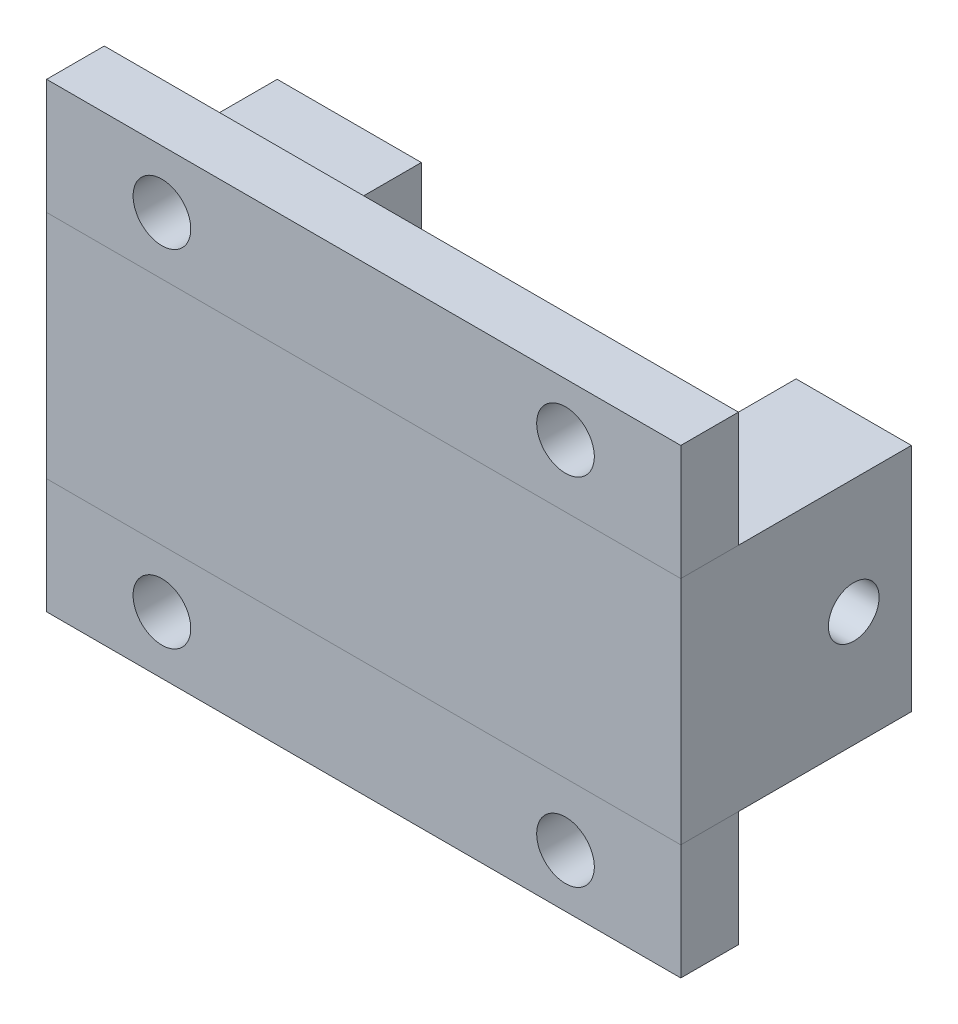
ISO-10303-21;
HEADER;
FILE_DESCRIPTION(('STEP AP214'),'2;1');
FILE_NAME('part.step','',(''),(''),'','','');
FILE_SCHEMA(('AUTOMOTIVE_DESIGN { 1 0 10303 214 1 1 1 1 }'));
ENDSEC;
DATA;
#1=APPLICATION_CONTEXT('core data for automotive mechanical design processes');
#2=APPLICATION_PROTOCOL_DEFINITION('international standard','automotive_design',2000,#1);
#3=PRODUCT_CONTEXT('',#1,'mechanical');
#4=PRODUCT('Part','Part','',(#3));
#5=PRODUCT_RELATED_PRODUCT_CATEGORY('part','',(#4));
#6=PRODUCT_DEFINITION_FORMATION('','',#4);
#7=PRODUCT_DEFINITION_CONTEXT('part definition',#1,'design');
#8=PRODUCT_DEFINITION('design','',#6,#7);
#9=PRODUCT_DEFINITION_SHAPE('','',#8);
#10=(LENGTH_UNIT() NAMED_UNIT(*) SI_UNIT(.MILLI.,.METRE.));
#11=(NAMED_UNIT(*) PLANE_ANGLE_UNIT() SI_UNIT($,.RADIAN.));
#12=(NAMED_UNIT(*) SI_UNIT($,.STERADIAN.) SOLID_ANGLE_UNIT());
#13=UNCERTAINTY_MEASURE_WITH_UNIT(LENGTH_MEASURE(1.E-05),#10,'distance_accuracy_value','');
#14=(GEOMETRIC_REPRESENTATION_CONTEXT(3) GLOBAL_UNCERTAINTY_ASSIGNED_CONTEXT((#13)) GLOBAL_UNIT_ASSIGNED_CONTEXT((#10,
#11,#12)) REPRESENTATION_CONTEXT('',''));
#15=CARTESIAN_POINT('',(0.,0.,0.));
#16=DIRECTION('',(0.,0.,1.));
#17=DIRECTION('',(1.,0.,0.));
#18=AXIS2_PLACEMENT_3D('',#15,#16,#17);
#19=CARTESIAN_POINT('',(0.,-40.,-10.));
#20=DIRECTION('',(0.,0.,-1.));
#21=DIRECTION('',(-1.,0.,0.));
#22=AXIS2_PLACEMENT_3D('',#19,#20,#21);
#23=PLANE('',#22);
#24=CARTESIAN_POINT('',(20.,-30.,-10.));
#25=DIRECTION('',(0.,0.,1.));
#26=DIRECTION('',(-1.,0.,0.));
#27=AXIS2_PLACEMENT_3D('',#24,#25,#26);
#28=CIRCLE('',#27,5.);
#29=CARTESIAN_POINT('',(15.,-30.,-10.));
#30=VERTEX_POINT('',#29);
#31=EDGE_CURVE('E146',#30,#30,#28,.T.);
#32=ORIENTED_EDGE('',*,*,#31,.T.);
#33=EDGE_LOOP('',(#32));
#34=FACE_BOUND('',#33,.T.);
#35=CARTESIAN_POINT('',(90.,-30.8146167179204,-10.));
#36=DIRECTION('',(0.,0.,1.));
#37=DIRECTION('',(-1.,0.,0.));
#38=AXIS2_PLACEMENT_3D('',#35,#36,#37);
#39=CIRCLE('',#38,5.);
#40=CARTESIAN_POINT('',(85.,-30.8146167179204,-10.));
#41=VERTEX_POINT('',#40);
#42=EDGE_CURVE('E149',#41,#41,#39,.T.);
#43=ORIENTED_EDGE('',*,*,#42,.T.);
#44=EDGE_LOOP('',(#43));
#45=FACE_BOUND('',#44,.T.);
#46=DIRECTION('',(1.,0.,0.));
#47=VECTOR('',#46,1.);
#48=CARTESIAN_POINT('',(0.,-20.,-10.));
#49=LINE('',#48,#47);
#50=CARTESIAN_POINT('',(0.,-20.,-10.));
#51=VERTEX_POINT('',#50);
#52=CARTESIAN_POINT('',(110.,-20.,-10.));
#53=VERTEX_POINT('',#52);
#54=EDGE_CURVE('E115',#51,#53,#49,.T.);
#55=ORIENTED_EDGE('',*,*,#54,.T.);
#56=DIRECTION('',(0.,1.,0.));
#57=VECTOR('',#56,1.);
#58=CARTESIAN_POINT('',(110.,-40.,-10.));
#59=LINE('',#58,#57);
#60=CARTESIAN_POINT('',(110.,-40.,-10.));
#61=VERTEX_POINT('',#60);
#62=EDGE_CURVE('E114',#61,#53,#59,.T.);
#63=ORIENTED_EDGE('',*,*,#62,.F.);
#64=DIRECTION('',(1.,0.,0.));
#65=VECTOR('',#64,1.);
#66=CARTESIAN_POINT('',(0.,-40.,-10.));
#67=LINE('',#66,#65);
#68=CARTESIAN_POINT('',(0.,-40.,-10.));
#69=VERTEX_POINT('',#68);
#70=EDGE_CURVE('E108',#69,#61,#67,.T.);
#71=ORIENTED_EDGE('',*,*,#70,.F.);
#72=DIRECTION('',(0.,1.,0.));
#73=VECTOR('',#72,1.);
#74=CARTESIAN_POINT('',(0.,-40.,-10.));
#75=LINE('',#74,#73);
#76=EDGE_CURVE('E12',#69,#51,#75,.T.);
#77=ORIENTED_EDGE('',*,*,#76,.T.);
#78=EDGE_LOOP('',(#55,#63,#71,#77));
#79=FACE_BOUND('',#78,.T.);
#80=ADVANCED_FACE('F51',(#34,#45,#79),#23,.T.);
#81=CARTESIAN_POINT('',(0.,-40.,0.));
#82=DIRECTION('',(1.,0.,0.));
#83=DIRECTION('',(0.,0.,-1.));
#84=AXIS2_PLACEMENT_3D('',#81,#82,#83);
#85=PLANE('',#84);
#86=DIRECTION('',(0.,0.,1.));
#87=VECTOR('',#86,1.);
#88=CARTESIAN_POINT('',(0.,-20.,0.));
#89=LINE('',#88,#87);
#90=CARTESIAN_POINT('',(0.,-20.,0.));
#91=VERTEX_POINT('',#90);
#92=EDGE_CURVE('E118',#51,#91,#89,.T.);
#93=ORIENTED_EDGE('',*,*,#92,.F.);
#94=ORIENTED_EDGE('',*,*,#76,.F.);
#95=DIRECTION('',(0.,0.,1.));
#96=VECTOR('',#95,1.);
#97=CARTESIAN_POINT('',(0.,-40.,0.));
#98=LINE('',#97,#96);
#99=CARTESIAN_POINT('',(0.,-40.,0.));
#100=VERTEX_POINT('',#99);
#101=EDGE_CURVE('E92',#69,#100,#98,.T.);
#102=ORIENTED_EDGE('',*,*,#101,.T.);
#103=DIRECTION('',(0.,1.,0.));
#104=VECTOR('',#103,1.);
#105=CARTESIAN_POINT('',(0.,-40.,0.));
#106=LINE('',#105,#104);
#107=EDGE_CURVE('E59',#100,#91,#106,.T.);
#108=ORIENTED_EDGE('',*,*,#107,.T.);
#109=EDGE_LOOP('',(#93,#94,#102,#108));
#110=FACE_BOUND('',#109,.T.);
#111=ADVANCED_FACE('F106',(#110),#85,.F.);
#112=CARTESIAN_POINT('',(0.,-40.,0.));
#113=DIRECTION('',(0.,0.,-1.));
#114=DIRECTION('',(-1.,0.,0.));
#115=AXIS2_PLACEMENT_3D('',#112,#113,#114);
#116=PLANE('',#115);
#117=CARTESIAN_POINT('',(20.,-30.,0.));
#118=DIRECTION('',(0.,0.,1.));
#119=DIRECTION('',(-1.,0.,0.));
#120=AXIS2_PLACEMENT_3D('',#117,#118,#119);
#121=CIRCLE('',#120,5.);
#122=CARTESIAN_POINT('',(15.,-30.,0.));
#123=VERTEX_POINT('',#122);
#124=EDGE_CURVE('E151',#123,#123,#121,.T.);
#125=ORIENTED_EDGE('',*,*,#124,.F.);
#126=EDGE_LOOP('',(#125));
#127=FACE_BOUND('',#126,.T.);
#128=CARTESIAN_POINT('',(90.,-30.8146167179204,0.));
#129=DIRECTION('',(0.,0.,1.));
#130=DIRECTION('',(-1.,0.,0.));
#131=AXIS2_PLACEMENT_3D('',#128,#129,#130);
#132=CIRCLE('',#131,5.);
#133=CARTESIAN_POINT('',(85.,-30.8146167179204,0.));
#134=VERTEX_POINT('',#133);
#135=EDGE_CURVE('E119',#134,#134,#132,.T.);
#136=ORIENTED_EDGE('',*,*,#135,.F.);
#137=EDGE_LOOP('',(#136));
#138=FACE_BOUND('',#137,.T.);
#139=DIRECTION('',(1.,0.,0.));
#140=VECTOR('',#139,1.);
#141=CARTESIAN_POINT('',(0.,-20.,0.));
#142=LINE('',#141,#140);
#143=CARTESIAN_POINT('',(110.,-20.,0.));
#144=VERTEX_POINT('',#143);
#145=EDGE_CURVE('E102',#91,#144,#142,.T.);
#146=ORIENTED_EDGE('',*,*,#145,.F.);
#147=ORIENTED_EDGE('',*,*,#107,.F.);
#148=DIRECTION('',(1.,0.,0.));
#149=VECTOR('',#148,1.);
#150=CARTESIAN_POINT('',(0.,-40.,0.));
#151=LINE('',#150,#149);
#152=CARTESIAN_POINT('',(110.,-40.,0.));
#153=VERTEX_POINT('',#152);
#154=EDGE_CURVE('E95',#100,#153,#151,.T.);
#155=ORIENTED_EDGE('',*,*,#154,.T.);
#156=DIRECTION('',(0.,1.,0.));
#157=VECTOR('',#156,1.);
#158=CARTESIAN_POINT('',(110.,-40.,0.));
#159=LINE('',#158,#157);
#160=EDGE_CURVE('E105',#153,#144,#159,.T.);
#161=ORIENTED_EDGE('',*,*,#160,.T.);
#162=EDGE_LOOP('',(#146,#147,#155,#161));
#163=FACE_BOUND('',#162,.T.);
#164=ADVANCED_FACE('F101',(#127,#138,#163),#116,.F.);
#165=CARTESIAN_POINT('',(110.,-40.,0.));
#166=DIRECTION('',(-1.,0.,0.));
#167=DIRECTION('',(0.,0.,1.));
#168=AXIS2_PLACEMENT_3D('',#165,#166,#167);
#169=PLANE('',#168);
#170=DIRECTION('',(0.,0.,-1.));
#171=VECTOR('',#170,1.);
#172=CARTESIAN_POINT('',(110.,-20.,0.));
#173=LINE('',#172,#171);
#174=EDGE_CURVE('E81',#144,#53,#173,.T.);
#175=ORIENTED_EDGE('',*,*,#174,.F.);
#176=ORIENTED_EDGE('',*,*,#160,.F.);
#177=DIRECTION('',(0.,0.,-1.));
#178=VECTOR('',#177,1.);
#179=CARTESIAN_POINT('',(110.,-40.,0.));
#180=LINE('',#179,#178);
#181=EDGE_CURVE('E67',#153,#61,#180,.T.);
#182=ORIENTED_EDGE('',*,*,#181,.T.);
#183=ORIENTED_EDGE('',*,*,#62,.T.);
#184=EDGE_LOOP('',(#175,#176,#182,#183));
#185=FACE_BOUND('',#184,.T.);
#186=ADVANCED_FACE('F127',(#185),#169,.F.);
#187=CARTESIAN_POINT('',(0.,-40.,0.));
#188=DIRECTION('',(0.,-1.,0.));
#189=DIRECTION('',(0.,0.,1.));
#190=AXIS2_PLACEMENT_3D('',#187,#188,#189);
#191=PLANE('',#190);
#192=ORIENTED_EDGE('',*,*,#70,.T.);
#193=ORIENTED_EDGE('',*,*,#181,.F.);
#194=ORIENTED_EDGE('',*,*,#154,.F.);
#195=ORIENTED_EDGE('',*,*,#101,.F.);
#196=EDGE_LOOP('',(#192,#193,#194,#195));
#197=FACE_BOUND('',#196,.T.);
#198=ADVANCED_FACE('F97',(#197),#191,.T.);
#199=CARTESIAN_POINT('',(0.,-20.,0.));
#200=DIRECTION('',(0.,-1.,0.));
#201=DIRECTION('',(0.,0.,1.));
#202=AXIS2_PLACEMENT_3D('',#199,#200,#201);
#203=PLANE('',#202);
#204=ORIENTED_EDGE('',*,*,#54,.F.);
#205=ORIENTED_EDGE('',*,*,#92,.T.);
#206=ORIENTED_EDGE('',*,*,#145,.T.);
#207=ORIENTED_EDGE('',*,*,#174,.T.);
#208=EDGE_LOOP('',(#204,#205,#206,#207));
#209=FACE_BOUND('',#208,.T.);
#210=ADVANCED_FACE('F124',(#209),#203,.F.);
#211=CARTESIAN_POINT('',(90.,-30.8146167179204,-10.));
#212=DIRECTION('',(0.,0.,-1.));
#213=DIRECTION('',(-1.,0.,0.));
#214=AXIS2_PLACEMENT_3D('',#211,#212,#213);
#215=CYLINDRICAL_SURFACE('',#214,5.);
#216=ORIENTED_EDGE('',*,*,#135,.T.);
#217=EDGE_LOOP('',(#216));
#218=FACE_BOUND('',#217,.T.);
#219=ORIENTED_EDGE('',*,*,#42,.F.);
#220=EDGE_LOOP('',(#219));
#221=FACE_BOUND('',#220,.T.);
#222=ADVANCED_FACE('F164',(#218,#221),#215,.F.);
#223=CARTESIAN_POINT('',(20.,-30.,-10.));
#224=DIRECTION('',(0.,0.,-1.));
#225=DIRECTION('',(-1.,0.,0.));
#226=AXIS2_PLACEMENT_3D('',#223,#224,#225);
#227=CYLINDRICAL_SURFACE('',#226,5.);
#228=ORIENTED_EDGE('',*,*,#124,.T.);
#229=EDGE_LOOP('',(#228));
#230=FACE_BOUND('',#229,.T.);
#231=ORIENTED_EDGE('',*,*,#31,.F.);
#232=EDGE_LOOP('',(#231));
#233=FACE_BOUND('',#232,.T.);
#234=ADVANCED_FACE('F159',(#230,#233),#227,.F.);
#235=CLOSED_SHELL('',(#80,#111,#164,#186,#198,#210,#222,#234));
#236=MANIFOLD_SOLID_BREP('B2',#235);
#237=CARTESIAN_POINT('',(0.,40.,-10.));
#238=DIRECTION('',(0.,0.,-1.));
#239=DIRECTION('',(-1.,0.,0.));
#240=AXIS2_PLACEMENT_3D('',#237,#238,#239);
#241=PLANE('',#240);
#242=CARTESIAN_POINT('',(20.,30.,-10.));
#243=DIRECTION('',(0.,0.,-1.));
#244=DIRECTION('',(-1.,0.,0.));
#245=AXIS2_PLACEMENT_3D('',#242,#243,#244);
#246=CIRCLE('',#245,5.);
#247=CARTESIAN_POINT('',(15.,30.,-10.));
#248=VERTEX_POINT('',#247);
#249=EDGE_CURVE('E327',#248,#248,#246,.T.);
#250=ORIENTED_EDGE('',*,*,#249,.F.);
#251=EDGE_LOOP('',(#250));
#252=FACE_BOUND('',#251,.T.);
#253=CARTESIAN_POINT('',(90.,30.8146167179204,-10.));
#254=DIRECTION('',(0.,0.,-1.));
#255=DIRECTION('',(-1.,0.,0.));
#256=AXIS2_PLACEMENT_3D('',#253,#254,#255);
#257=CIRCLE('',#256,5.);
#258=CARTESIAN_POINT('',(85.,30.8146167179204,-10.));
#259=VERTEX_POINT('',#258);
#260=EDGE_CURVE('E330',#259,#259,#257,.T.);
#261=ORIENTED_EDGE('',*,*,#260,.F.);
#262=EDGE_LOOP('',(#261));
#263=FACE_BOUND('',#262,.T.);
#264=DIRECTION('',(1.,0.,0.));
#265=VECTOR('',#264,1.);
#266=CARTESIAN_POINT('',(0.,20.,-10.));
#267=LINE('',#266,#265);
#268=CARTESIAN_POINT('',(0.,20.,-10.));
#269=VERTEX_POINT('',#268);
#270=CARTESIAN_POINT('',(110.,20.,-10.));
#271=VERTEX_POINT('',#270);
#272=EDGE_CURVE('E305',#269,#271,#267,.T.);
#273=ORIENTED_EDGE('',*,*,#272,.F.);
#274=DIRECTION('',(0.,-1.,0.));
#275=VECTOR('',#274,1.);
#276=CARTESIAN_POINT('',(0.,40.,-10.));
#277=LINE('',#276,#275);
#278=CARTESIAN_POINT('',(0.,40.,-10.));
#279=VERTEX_POINT('',#278);
#280=EDGE_CURVE('E49',#279,#269,#277,.T.);
#281=ORIENTED_EDGE('',*,*,#280,.F.);
#282=DIRECTION('',(1.,0.,0.));
#283=VECTOR('',#282,1.);
#284=CARTESIAN_POINT('',(0.,40.,-10.));
#285=LINE('',#284,#283);
#286=CARTESIAN_POINT('',(110.,40.,-10.));
#287=VERTEX_POINT('',#286);
#288=EDGE_CURVE('E293',#279,#287,#285,.T.);
#289=ORIENTED_EDGE('',*,*,#288,.T.);
#290=DIRECTION('',(0.,-1.,0.));
#291=VECTOR('',#290,1.);
#292=CARTESIAN_POINT('',(110.,40.,-10.));
#293=LINE('',#292,#291);
#294=EDGE_CURVE('E282',#287,#271,#293,.T.);
#295=ORIENTED_EDGE('',*,*,#294,.T.);
#296=EDGE_LOOP('',(#273,#281,#289,#295));
#297=FACE_BOUND('',#296,.T.);
#298=ADVANCED_FACE('F243',(#252,#263,#297),#241,.T.);
#299=CARTESIAN_POINT('',(0.,40.,0.));
#300=DIRECTION('',(1.,0.,0.));
#301=DIRECTION('',(0.,0.,-1.));
#302=AXIS2_PLACEMENT_3D('',#299,#300,#301);
#303=PLANE('',#302);
#304=DIRECTION('',(0.,0.,1.));
#305=VECTOR('',#304,1.);
#306=CARTESIAN_POINT('',(0.,20.,0.));
#307=LINE('',#306,#305);
#308=CARTESIAN_POINT('',(0.,20.,0.));
#309=VERTEX_POINT('',#308);
#310=EDGE_CURVE('E298',#269,#309,#307,.T.);
#311=ORIENTED_EDGE('',*,*,#310,.T.);
#312=DIRECTION('',(0.,-1.,0.));
#313=VECTOR('',#312,1.);
#314=CARTESIAN_POINT('',(0.,40.,0.));
#315=LINE('',#314,#313);
#316=CARTESIAN_POINT('',(0.,40.,0.));
#317=VERTEX_POINT('',#316);
#318=EDGE_CURVE('E251',#317,#309,#315,.T.);
#319=ORIENTED_EDGE('',*,*,#318,.F.);
#320=DIRECTION('',(0.,0.,1.));
#321=VECTOR('',#320,1.);
#322=CARTESIAN_POINT('',(0.,40.,0.));
#323=LINE('',#322,#321);
#324=EDGE_CURVE('E288',#279,#317,#323,.T.);
#325=ORIENTED_EDGE('',*,*,#324,.F.);
#326=ORIENTED_EDGE('',*,*,#280,.T.);
#327=EDGE_LOOP('',(#311,#319,#325,#326));
#328=FACE_BOUND('',#327,.T.);
#329=ADVANCED_FACE('F296',(#328),#303,.F.);
#330=CARTESIAN_POINT('',(0.,40.,0.));
#331=DIRECTION('',(0.,0.,-1.));
#332=DIRECTION('',(-1.,0.,0.));
#333=AXIS2_PLACEMENT_3D('',#330,#331,#332);
#334=PLANE('',#333);
#335=CARTESIAN_POINT('',(20.,30.,0.));
#336=DIRECTION('',(0.,0.,-1.));
#337=DIRECTION('',(-1.,0.,0.));
#338=AXIS2_PLACEMENT_3D('',#335,#336,#337);
#339=CIRCLE('',#338,5.);
#340=CARTESIAN_POINT('',(15.,30.,0.));
#341=VERTEX_POINT('',#340);
#342=EDGE_CURVE('E332',#341,#341,#339,.T.);
#343=ORIENTED_EDGE('',*,*,#342,.T.);
#344=EDGE_LOOP('',(#343));
#345=FACE_BOUND('',#344,.T.);
#346=CARTESIAN_POINT('',(90.,30.8146167179204,0.));
#347=DIRECTION('',(0.,0.,-1.));
#348=DIRECTION('',(-1.,0.,0.));
#349=AXIS2_PLACEMENT_3D('',#346,#347,#348);
#350=CIRCLE('',#349,5.);
#351=CARTESIAN_POINT('',(85.,30.8146167179204,0.));
#352=VERTEX_POINT('',#351);
#353=EDGE_CURVE('E308',#352,#352,#350,.T.);
#354=ORIENTED_EDGE('',*,*,#353,.T.);
#355=EDGE_LOOP('',(#354));
#356=FACE_BOUND('',#355,.T.);
#357=DIRECTION('',(1.,0.,0.));
#358=VECTOR('',#357,1.);
#359=CARTESIAN_POINT('',(0.,20.,0.));
#360=LINE('',#359,#358);
#361=CARTESIAN_POINT('',(110.,20.,0.));
#362=VERTEX_POINT('',#361);
#363=EDGE_CURVE('E275',#309,#362,#360,.T.);
#364=ORIENTED_EDGE('',*,*,#363,.T.);
#365=DIRECTION('',(0.,-1.,0.));
#366=VECTOR('',#365,1.);
#367=CARTESIAN_POINT('',(110.,40.,0.));
#368=LINE('',#367,#366);
#369=CARTESIAN_POINT('',(110.,40.,0.));
#370=VERTEX_POINT('',#369);
#371=EDGE_CURVE('E299',#370,#362,#368,.T.);
#372=ORIENTED_EDGE('',*,*,#371,.F.);
#373=DIRECTION('',(1.,0.,0.));
#374=VECTOR('',#373,1.);
#375=CARTESIAN_POINT('',(0.,40.,0.));
#376=LINE('',#375,#374);
#377=EDGE_CURVE('E292',#317,#370,#376,.T.);
#378=ORIENTED_EDGE('',*,*,#377,.F.);
#379=ORIENTED_EDGE('',*,*,#318,.T.);
#380=EDGE_LOOP('',(#364,#372,#378,#379));
#381=FACE_BOUND('',#380,.T.);
#382=ADVANCED_FACE('F300',(#345,#356,#381),#334,.F.);
#383=CARTESIAN_POINT('',(110.,40.,0.));
#384=DIRECTION('',(-1.,0.,0.));
#385=DIRECTION('',(0.,0.,1.));
#386=AXIS2_PLACEMENT_3D('',#383,#384,#385);
#387=PLANE('',#386);
#388=DIRECTION('',(0.,0.,-1.));
#389=VECTOR('',#388,1.);
#390=CARTESIAN_POINT('',(110.,20.,0.));
#391=LINE('',#390,#389);
#392=EDGE_CURVE('E311',#362,#271,#391,.T.);
#393=ORIENTED_EDGE('',*,*,#392,.T.);
#394=ORIENTED_EDGE('',*,*,#294,.F.);
#395=DIRECTION('',(0.,0.,-1.));
#396=VECTOR('',#395,1.);
#397=CARTESIAN_POINT('',(110.,40.,0.));
#398=LINE('',#397,#396);
#399=EDGE_CURVE('E259',#370,#287,#398,.T.);
#400=ORIENTED_EDGE('',*,*,#399,.F.);
#401=ORIENTED_EDGE('',*,*,#371,.T.);
#402=EDGE_LOOP('',(#393,#394,#400,#401));
#403=FACE_BOUND('',#402,.T.);
#404=ADVANCED_FACE('F316',(#403),#387,.F.);
#405=CARTESIAN_POINT('',(0.,40.,0.));
#406=DIRECTION('',(0.,1.,0.));
#407=DIRECTION('',(0.,0.,1.));
#408=AXIS2_PLACEMENT_3D('',#405,#406,#407);
#409=PLANE('',#408);
#410=ORIENTED_EDGE('',*,*,#288,.F.);
#411=ORIENTED_EDGE('',*,*,#324,.T.);
#412=ORIENTED_EDGE('',*,*,#377,.T.);
#413=ORIENTED_EDGE('',*,*,#399,.T.);
#414=EDGE_LOOP('',(#410,#411,#412,#413));
#415=FACE_BOUND('',#414,.T.);
#416=ADVANCED_FACE('F290',(#415),#409,.T.);
#417=CARTESIAN_POINT('',(0.,20.,0.));
#418=DIRECTION('',(0.,1.,0.));
#419=DIRECTION('',(0.,0.,1.));
#420=AXIS2_PLACEMENT_3D('',#417,#418,#419);
#421=PLANE('',#420);
#422=ORIENTED_EDGE('',*,*,#272,.T.);
#423=ORIENTED_EDGE('',*,*,#392,.F.);
#424=ORIENTED_EDGE('',*,*,#363,.F.);
#425=ORIENTED_EDGE('',*,*,#310,.F.);
#426=EDGE_LOOP('',(#422,#423,#424,#425));
#427=FACE_BOUND('',#426,.T.);
#428=ADVANCED_FACE('F318',(#427),#421,.F.);
#429=CARTESIAN_POINT('',(90.,30.8146167179204,-10.));
#430=DIRECTION('',(0.,0.,-1.));
#431=DIRECTION('',(-1.,0.,0.));
#432=AXIS2_PLACEMENT_3D('',#429,#430,#431);
#433=CYLINDRICAL_SURFACE('',#432,5.);
#434=ORIENTED_EDGE('',*,*,#353,.F.);
#435=EDGE_LOOP('',(#434));
#436=FACE_BOUND('',#435,.T.);
#437=ORIENTED_EDGE('',*,*,#260,.T.);
#438=EDGE_LOOP('',(#437));
#439=FACE_BOUND('',#438,.T.);
#440=ADVANCED_FACE('F342',(#436,#439),#433,.F.);
#441=CARTESIAN_POINT('',(20.,30.,-10.));
#442=DIRECTION('',(0.,0.,-1.));
#443=DIRECTION('',(-1.,0.,0.));
#444=AXIS2_PLACEMENT_3D('',#441,#442,#443);
#445=CYLINDRICAL_SURFACE('',#444,5.);
#446=ORIENTED_EDGE('',*,*,#342,.F.);
#447=EDGE_LOOP('',(#446));
#448=FACE_BOUND('',#447,.T.);
#449=ORIENTED_EDGE('',*,*,#249,.T.);
#450=EDGE_LOOP('',(#449));
#451=FACE_BOUND('',#450,.T.);
#452=ADVANCED_FACE('F340',(#448,#451),#445,.F.);
#453=CLOSED_SHELL('',(#298,#329,#382,#404,#416,#428,#440,#452));
#454=MANIFOLD_SOLID_BREP('B6',#453);
#455=CARTESIAN_POINT('',(110.,20.,0.));
#456=DIRECTION('',(-1.,0.,0.));
#457=DIRECTION('',(0.,0.,1.));
#458=AXIS2_PLACEMENT_3D('',#455,#456,#457);
#459=PLANE('',#458);
#460=DIRECTION('',(0.,0.,-1.));
#461=VECTOR('',#460,1.);
#462=CARTESIAN_POINT('',(110.,-20.,0.));
#463=LINE('',#462,#461);
#464=CARTESIAN_POINT('',(110.,-20.,0.));
#465=VERTEX_POINT('',#464);
#466=CARTESIAN_POINT('',(110.,-20.,-40.));
#467=VERTEX_POINT('',#466);
#468=EDGE_CURVE('E675',#465,#467,#463,.T.);
#469=ORIENTED_EDGE('',*,*,#468,.T.);
#470=DIRECTION('',(0.,-1.,0.));
#471=VECTOR('',#470,1.);
#472=CARTESIAN_POINT('',(110.,20.,-40.));
#473=LINE('',#472,#471);
#474=CARTESIAN_POINT('',(110.,20.,-40.));
#475=VERTEX_POINT('',#474);
#476=EDGE_CURVE('E573',#475,#467,#473,.T.);
#477=ORIENTED_EDGE('',*,*,#476,.F.);
#478=DIRECTION('',(0.,0.,-1.));
#479=VECTOR('',#478,1.);
#480=CARTESIAN_POINT('',(110.,20.,0.));
#481=LINE('',#480,#479);
#482=CARTESIAN_POINT('',(110.,20.,0.));
#483=VERTEX_POINT('',#482);
#484=EDGE_CURVE('E551',#483,#475,#481,.T.);
#485=ORIENTED_EDGE('',*,*,#484,.F.);
#486=DIRECTION('',(0.,-1.,0.));
#487=VECTOR('',#486,1.);
#488=CARTESIAN_POINT('',(110.,20.,0.));
#489=LINE('',#488,#487);
#490=EDGE_CURVE('E548',#483,#465,#489,.T.);
#491=ORIENTED_EDGE('',*,*,#490,.T.);
#492=EDGE_LOOP('',(#469,#477,#485,#491));
#493=FACE_BOUND('',#492,.T.);
#494=CARTESIAN_POINT('',(110.,0.,-30.));
#495=DIRECTION('',(1.,0.,0.));
#496=DIRECTION('',(0.,0.,-1.));
#497=AXIS2_PLACEMENT_3D('',#494,#495,#496);
#498=CIRCLE('',#497,4.39999999999999);
#499=CARTESIAN_POINT('',(110.,0.,-34.4));
#500=VERTEX_POINT('',#499);
#501=EDGE_CURVE('E702',#500,#500,#498,.T.);
#502=ORIENTED_EDGE('',*,*,#501,.F.);
#503=EDGE_LOOP('',(#502));
#504=FACE_BOUND('',#503,.T.);
#505=ADVANCED_FACE('F429',(#493,#504),#459,.F.);
#506=CARTESIAN_POINT('',(25.,-20.01,-20.));
#507=DIRECTION('',(0.,0.,1.));
#508=DIRECTION('',(1.,0.,0.));
#509=AXIS2_PLACEMENT_3D('',#506,#507,#508);
#510=PLANE('',#509);
#511=DIRECTION('',(0.,1.,0.));
#512=VECTOR('',#511,1.);
#513=CARTESIAN_POINT('',(25.,-20.01,-20.));
#514=LINE('',#513,#512);
#515=CARTESIAN_POINT('',(25.,-20.,-20.));
#516=VERTEX_POINT('',#515);
#517=CARTESIAN_POINT('',(25.,-5.,-20.));
#518=VERTEX_POINT('',#517);
#519=EDGE_CURVE('E451',#516,#518,#514,.T.);
#520=ORIENTED_EDGE('',*,*,#519,.T.);
#521=CARTESIAN_POINT('',(30.,-5.,-20.));
#522=DIRECTION('',(0.,0.,1.));
#523=DIRECTION('',(1.,0.,0.));
#524=AXIS2_PLACEMENT_3D('',#521,#522,#523);
#525=CIRCLE('',#524,5.);
#526=CARTESIAN_POINT('',(30.,-10.,-20.));
#527=VERTEX_POINT('',#526);
#528=EDGE_CURVE('E241',#518,#527,#525,.T.);
#529=ORIENTED_EDGE('',*,*,#528,.T.);
#530=DIRECTION('',(1.,0.,0.));
#531=VECTOR('',#530,1.);
#532=CARTESIAN_POINT('',(25.,-10.,-20.));
#533=LINE('',#532,#531);
#534=CARTESIAN_POINT('',(85.,-10.,-20.));
#535=VERTEX_POINT('',#534);
#536=EDGE_CURVE('E651',#527,#535,#533,.T.);
#537=ORIENTED_EDGE('',*,*,#536,.T.);
#538=CARTESIAN_POINT('',(85.,-5.00000000000001,-20.));
#539=DIRECTION('',(0.,0.,1.));
#540=DIRECTION('',(1.,0.,0.));
#541=AXIS2_PLACEMENT_3D('',#538,#539,#540);
#542=CIRCLE('',#541,5.);
#543=CARTESIAN_POINT('',(90.,-5.00000000000001,-20.));
#544=VERTEX_POINT('',#543);
#545=EDGE_CURVE('E626',#535,#544,#542,.T.);
#546=ORIENTED_EDGE('',*,*,#545,.T.);
#547=DIRECTION('',(0.,1.,0.));
#548=VECTOR('',#547,1.);
#549=CARTESIAN_POINT('',(90.,-20.01,-20.));
#550=LINE('',#549,#548);
#551=CARTESIAN_POINT('',(90.,-20.,-20.));
#552=VERTEX_POINT('',#551);
#553=EDGE_CURVE('E590',#552,#544,#550,.T.);
#554=ORIENTED_EDGE('',*,*,#553,.F.);
#555=DIRECTION('',(-1.,0.,0.));
#556=VECTOR('',#555,1.);
#557=CARTESIAN_POINT('',(0.,-20.,-20.));
#558=LINE('',#557,#556);
#559=EDGE_CURVE('E580',#552,#516,#558,.T.);
#560=ORIENTED_EDGE('',*,*,#559,.T.);
#561=EDGE_LOOP('',(#520,#529,#537,#546,#554,#560));
#562=FACE_BOUND('',#561,.T.);
#563=ADVANCED_FACE('F698',(#562),#510,.F.);
#564=CARTESIAN_POINT('',(90.,4.99999999999999,-20.));
#565=VERTEX_POINT('',#564);
#566=CARTESIAN_POINT('',(90.,20.,-20.));
#567=VERTEX_POINT('',#566);
#568=EDGE_CURVE('E593',#565,#567,#550,.T.);
#569=ORIENTED_EDGE('',*,*,#568,.F.);
#570=CARTESIAN_POINT('',(85.,4.99999999999999,-20.));
#571=DIRECTION('',(0.,0.,1.));
#572=DIRECTION('',(1.,0.,0.));
#573=AXIS2_PLACEMENT_3D('',#570,#571,#572);
#574=CIRCLE('',#573,5.);
#575=CARTESIAN_POINT('',(85.,9.99999999999999,-20.));
#576=VERTEX_POINT('',#575);
#577=EDGE_CURVE('E624',#565,#576,#574,.T.);
#578=ORIENTED_EDGE('',*,*,#577,.T.);
#579=DIRECTION('',(1.,0.,0.));
#580=VECTOR('',#579,1.);
#581=CARTESIAN_POINT('',(25.,10.,-20.));
#582=LINE('',#581,#580);
#583=CARTESIAN_POINT('',(30.,10.,-20.));
#584=VERTEX_POINT('',#583);
#585=EDGE_CURVE('E634',#584,#576,#582,.T.);
#586=ORIENTED_EDGE('',*,*,#585,.F.);
#587=CARTESIAN_POINT('',(30.,5.,-20.));
#588=DIRECTION('',(0.,0.,1.));
#589=DIRECTION('',(1.,0.,0.));
#590=AXIS2_PLACEMENT_3D('',#587,#588,#589);
#591=CIRCLE('',#590,5.);
#592=CARTESIAN_POINT('',(25.,5.,-20.));
#593=VERTEX_POINT('',#592);
#594=EDGE_CURVE('E437',#584,#593,#591,.T.);
#595=ORIENTED_EDGE('',*,*,#594,.T.);
#596=CARTESIAN_POINT('',(25.,20.,-20.));
#597=VERTEX_POINT('',#596);
#598=EDGE_CURVE('E444',#593,#597,#514,.T.);
#599=ORIENTED_EDGE('',*,*,#598,.T.);
#600=DIRECTION('',(-1.,0.,0.));
#601=VECTOR('',#600,1.);
#602=CARTESIAN_POINT('',(0.,20.,-20.));
#603=LINE('',#602,#601);
#604=EDGE_CURVE('E571',#567,#597,#603,.T.);
#605=ORIENTED_EDGE('',*,*,#604,.F.);
#606=EDGE_LOOP('',(#569,#578,#586,#595,#599,#605));
#607=FACE_BOUND('',#606,.T.);
#608=ADVANCED_FACE('F631',(#607),#510,.F.);
#609=CARTESIAN_POINT('',(90.,-20.01,-20.));
#610=DIRECTION('',(1.,0.,0.));
#611=DIRECTION('',(0.,0.,-1.));
#612=AXIS2_PLACEMENT_3D('',#609,#610,#611);
#613=PLANE('',#612);
#614=CARTESIAN_POINT('',(90.,0.,-30.));
#615=DIRECTION('',(1.,0.,0.));
#616=DIRECTION('',(0.,0.,-1.));
#617=AXIS2_PLACEMENT_3D('',#614,#615,#616);
#618=CIRCLE('',#617,4.39999999999999);
#619=CARTESIAN_POINT('',(90.,0.,-34.4));
#620=VERTEX_POINT('',#619);
#621=EDGE_CURVE('E658',#620,#620,#618,.T.);
#622=ORIENTED_EDGE('',*,*,#621,.T.);
#623=EDGE_LOOP('',(#622));
#624=FACE_BOUND('',#623,.T.);
#625=DIRECTION('',(0.,1.,0.));
#626=VECTOR('',#625,1.);
#627=CARTESIAN_POINT('',(90.,-10.,-13.));
#628=LINE('',#627,#626);
#629=CARTESIAN_POINT('',(90.,-5.00000000000001,-13.));
#630=VERTEX_POINT('',#629);
#631=CARTESIAN_POINT('',(90.,4.99999999999999,-13.));
#632=VERTEX_POINT('',#631);
#633=EDGE_CURVE('E653',#630,#632,#628,.T.);
#634=ORIENTED_EDGE('',*,*,#633,.T.);
#635=DIRECTION('',(0.,0.,-1.));
#636=VECTOR('',#635,1.);
#637=CARTESIAN_POINT('',(90.,4.99999999999999,-20.));
#638=LINE('',#637,#636);
#639=EDGE_CURVE('E598',#632,#565,#638,.T.);
#640=ORIENTED_EDGE('',*,*,#639,.T.);
#641=ORIENTED_EDGE('',*,*,#568,.T.);
#642=DIRECTION('',(0.,0.,1.));
#643=VECTOR('',#642,1.);
#644=CARTESIAN_POINT('',(90.,20.,0.));
#645=LINE('',#644,#643);
#646=CARTESIAN_POINT('',(90.,20.,-40.));
#647=VERTEX_POINT('',#646);
#648=EDGE_CURVE('E568',#647,#567,#645,.T.);
#649=ORIENTED_EDGE('',*,*,#648,.F.);
#650=DIRECTION('',(0.,1.,0.));
#651=VECTOR('',#650,1.);
#652=CARTESIAN_POINT('',(90.,20.,-40.));
#653=LINE('',#652,#651);
#654=CARTESIAN_POINT('',(90.,-20.,-40.));
#655=VERTEX_POINT('',#654);
#656=EDGE_CURVE('E589',#655,#647,#653,.T.);
#657=ORIENTED_EDGE('',*,*,#656,.F.);
#658=DIRECTION('',(0.,0.,1.));
#659=VECTOR('',#658,1.);
#660=CARTESIAN_POINT('',(90.,-20.,0.));
#661=LINE('',#660,#659);
#662=EDGE_CURVE('E577',#655,#552,#661,.T.);
#663=ORIENTED_EDGE('',*,*,#662,.T.);
#664=ORIENTED_EDGE('',*,*,#553,.T.);
#665=DIRECTION('',(0.,0.,-1.));
#666=VECTOR('',#665,1.);
#667=CARTESIAN_POINT('',(90.,-5.00000000000001,-20.));
#668=LINE('',#667,#666);
#669=EDGE_CURVE('E592',#544,#630,#668,.F.);
#670=ORIENTED_EDGE('',*,*,#669,.T.);
#671=EDGE_LOOP('',(#634,#640,#641,#649,#657,#663,#664,#670));
#672=FACE_BOUND('',#671,.T.);
#673=ADVANCED_FACE('F694',(#624,#672),#613,.F.);
#674=CARTESIAN_POINT('',(25.,-20.01,-50.3852496544941));
#675=DIRECTION('',(-1.,0.,0.));
#676=DIRECTION('',(0.,0.,1.));
#677=AXIS2_PLACEMENT_3D('',#674,#675,#676);
#678=PLANE('',#677);
#679=ORIENTED_EDGE('',*,*,#598,.F.);
#680=DIRECTION('',(0.,0.,-1.));
#681=VECTOR('',#680,1.);
#682=CARTESIAN_POINT('',(25.,5.,-13.));
#683=LINE('',#682,#681);
#684=CARTESIAN_POINT('',(25.,5.,-13.));
#685=VERTEX_POINT('',#684);
#686=EDGE_CURVE('E622',#593,#685,#683,.F.);
#687=ORIENTED_EDGE('',*,*,#686,.T.);
#688=DIRECTION('',(0.,1.,0.));
#689=VECTOR('',#688,1.);
#690=CARTESIAN_POINT('',(25.,-10.,-13.));
#691=LINE('',#690,#689);
#692=CARTESIAN_POINT('',(25.,-5.,-13.));
#693=VERTEX_POINT('',#692);
#694=EDGE_CURVE('E642',#693,#685,#691,.T.);
#695=ORIENTED_EDGE('',*,*,#694,.F.);
#696=DIRECTION('',(0.,0.,-1.));
#697=VECTOR('',#696,1.);
#698=CARTESIAN_POINT('',(25.,-5.,-50.3852496544941));
#699=LINE('',#698,#697);
#700=EDGE_CURVE('E619',#693,#518,#699,.T.);
#701=ORIENTED_EDGE('',*,*,#700,.T.);
#702=ORIENTED_EDGE('',*,*,#519,.F.);
#703=DIRECTION('',(0.,0.,-1.));
#704=VECTOR('',#703,1.);
#705=CARTESIAN_POINT('',(25.,-20.,0.));
#706=LINE('',#705,#704);
#707=CARTESIAN_POINT('',(25.,-20.,-40.));
#708=VERTEX_POINT('',#707);
#709=EDGE_CURVE('E582',#516,#708,#706,.T.);
#710=ORIENTED_EDGE('',*,*,#709,.T.);
#711=DIRECTION('',(0.,-1.,0.));
#712=VECTOR('',#711,1.);
#713=CARTESIAN_POINT('',(25.,20.,-40.));
#714=LINE('',#713,#712);
#715=CARTESIAN_POINT('',(25.,20.,-40.));
#716=VERTEX_POINT('',#715);
#717=EDGE_CURVE('E584',#716,#708,#714,.T.);
#718=ORIENTED_EDGE('',*,*,#717,.F.);
#719=DIRECTION('',(0.,0.,-1.));
#720=VECTOR('',#719,1.);
#721=CARTESIAN_POINT('',(25.,20.,0.));
#722=LINE('',#721,#720);
#723=EDGE_CURVE('E587',#597,#716,#722,.T.);
#724=ORIENTED_EDGE('',*,*,#723,.F.);
#725=EDGE_LOOP('',(#679,#687,#695,#701,#702,#710,#718,#724));
#726=FACE_BOUND('',#725,.T.);
#727=ADVANCED_FACE('F641',(#726),#678,.F.);
#728=CARTESIAN_POINT('',(0.,20.,-40.));
#729=DIRECTION('',(0.,0.,1.));
#730=DIRECTION('',(1.,0.,0.));
#731=AXIS2_PLACEMENT_3D('',#728,#729,#730);
#732=PLANE('',#731);
#733=DIRECTION('',(-1.,0.,0.));
#734=VECTOR('',#733,1.);
#735=CARTESIAN_POINT('',(0.,20.,-40.));
#736=LINE('',#735,#734);
#737=CARTESIAN_POINT('',(0.,20.,-40.));
#738=VERTEX_POINT('',#737);
#739=EDGE_CURVE('E559',#716,#738,#736,.T.);
#740=ORIENTED_EDGE('',*,*,#739,.F.);
#741=ORIENTED_EDGE('',*,*,#717,.T.);
#742=DIRECTION('',(-1.,0.,0.));
#743=VECTOR('',#742,1.);
#744=CARTESIAN_POINT('',(0.,-20.,-40.));
#745=LINE('',#744,#743);
#746=CARTESIAN_POINT('',(0.,-20.,-40.));
#747=VERTEX_POINT('',#746);
#748=EDGE_CURVE('E677',#708,#747,#745,.T.);
#749=ORIENTED_EDGE('',*,*,#748,.T.);
#750=DIRECTION('',(0.,-1.,0.));
#751=VECTOR('',#750,1.);
#752=CARTESIAN_POINT('',(0.,20.,-40.));
#753=LINE('',#752,#751);
#754=EDGE_CURVE('E671',#738,#747,#753,.T.);
#755=ORIENTED_EDGE('',*,*,#754,.F.);
#756=EDGE_LOOP('',(#740,#741,#749,#755));
#757=FACE_BOUND('',#756,.T.);
#758=ADVANCED_FACE('F724',(#757),#732,.F.);
#759=CARTESIAN_POINT('',(0.,20.,0.));
#760=DIRECTION('',(1.,0.,0.));
#761=DIRECTION('',(0.,0.,-1.));
#762=AXIS2_PLACEMENT_3D('',#759,#760,#761);
#763=PLANE('',#762);
#764=DIRECTION('',(0.,0.,1.));
#765=VECTOR('',#764,1.);
#766=CARTESIAN_POINT('',(0.,-20.,0.));
#767=LINE('',#766,#765);
#768=CARTESIAN_POINT('',(0.,-20.,0.));
#769=VERTEX_POINT('',#768);
#770=EDGE_CURVE('E567',#747,#769,#767,.T.);
#771=ORIENTED_EDGE('',*,*,#770,.T.);
#772=DIRECTION('',(0.,-1.,0.));
#773=VECTOR('',#772,1.);
#774=CARTESIAN_POINT('',(0.,20.,0.));
#775=LINE('',#774,#773);
#776=CARTESIAN_POINT('',(0.,20.,0.));
#777=VERTEX_POINT('',#776);
#778=EDGE_CURVE('E545',#777,#769,#775,.T.);
#779=ORIENTED_EDGE('',*,*,#778,.F.);
#780=DIRECTION('',(0.,0.,1.));
#781=VECTOR('',#780,1.);
#782=CARTESIAN_POINT('',(0.,20.,0.));
#783=LINE('',#782,#781);
#784=EDGE_CURVE('E552',#738,#777,#783,.T.);
#785=ORIENTED_EDGE('',*,*,#784,.F.);
#786=ORIENTED_EDGE('',*,*,#754,.T.);
#787=EDGE_LOOP('',(#771,#779,#785,#786));
#788=FACE_BOUND('',#787,.T.);
#789=ADVANCED_FACE('F565',(#788),#763,.F.);
#790=CARTESIAN_POINT('',(0.,20.,0.));
#791=DIRECTION('',(0.,0.,-1.));
#792=DIRECTION('',(-1.,0.,0.));
#793=AXIS2_PLACEMENT_3D('',#790,#791,#792);
#794=PLANE('',#793);
#795=DIRECTION('',(1.,0.,0.));
#796=VECTOR('',#795,1.);
#797=CARTESIAN_POINT('',(0.,-20.,0.));
#798=LINE('',#797,#796);
#799=EDGE_CURVE('E673',#769,#465,#798,.T.);
#800=ORIENTED_EDGE('',*,*,#799,.T.);
#801=ORIENTED_EDGE('',*,*,#490,.F.);
#802=DIRECTION('',(1.,0.,0.));
#803=VECTOR('',#802,1.);
#804=CARTESIAN_POINT('',(0.,20.,0.));
#805=LINE('',#804,#803);
#806=EDGE_CURVE('E541',#777,#483,#805,.T.);
#807=ORIENTED_EDGE('',*,*,#806,.F.);
#808=ORIENTED_EDGE('',*,*,#778,.T.);
#809=EDGE_LOOP('',(#800,#801,#807,#808));
#810=FACE_BOUND('',#809,.T.);
#811=ADVANCED_FACE('F543',(#810),#794,.F.);
#812=EDGE_CURVE('E563',#467,#655,#745,.T.);
#813=ORIENTED_EDGE('',*,*,#812,.T.);
#814=ORIENTED_EDGE('',*,*,#656,.T.);
#815=EDGE_CURVE('E668',#475,#647,#736,.T.);
#816=ORIENTED_EDGE('',*,*,#815,.F.);
#817=ORIENTED_EDGE('',*,*,#476,.T.);
#818=EDGE_LOOP('',(#813,#814,#816,#817));
#819=FACE_BOUND('',#818,.T.);
#820=ADVANCED_FACE('F685',(#819),#732,.F.);
#821=CARTESIAN_POINT('',(0.,20.,0.));
#822=DIRECTION('',(0.,-1.,0.));
#823=DIRECTION('',(0.,0.,-1.));
#824=AXIS2_PLACEMENT_3D('',#821,#822,#823);
#825=PLANE('',#824);
#826=ORIENTED_EDGE('',*,*,#604,.T.);
#827=ORIENTED_EDGE('',*,*,#723,.T.);
#828=ORIENTED_EDGE('',*,*,#739,.T.);
#829=ORIENTED_EDGE('',*,*,#784,.T.);
#830=ORIENTED_EDGE('',*,*,#806,.T.);
#831=ORIENTED_EDGE('',*,*,#484,.T.);
#832=ORIENTED_EDGE('',*,*,#815,.T.);
#833=ORIENTED_EDGE('',*,*,#648,.T.);
#834=EDGE_LOOP('',(#826,#827,#828,#829,#830,#831,#832,#833));
#835=FACE_BOUND('',#834,.T.);
#836=ADVANCED_FACE('F556',(#835),#825,.F.);
#837=CARTESIAN_POINT('',(0.,-20.,0.));
#838=DIRECTION('',(0.,-1.,0.));
#839=DIRECTION('',(0.,0.,-1.));
#840=AXIS2_PLACEMENT_3D('',#837,#838,#839);
#841=PLANE('',#840);
#842=ORIENTED_EDGE('',*,*,#709,.F.);
#843=ORIENTED_EDGE('',*,*,#559,.F.);
#844=ORIENTED_EDGE('',*,*,#662,.F.);
#845=ORIENTED_EDGE('',*,*,#812,.F.);
#846=ORIENTED_EDGE('',*,*,#468,.F.);
#847=ORIENTED_EDGE('',*,*,#799,.F.);
#848=ORIENTED_EDGE('',*,*,#770,.F.);
#849=ORIENTED_EDGE('',*,*,#748,.F.);
#850=EDGE_LOOP('',(#842,#843,#844,#845,#846,#847,#848,#849));
#851=FACE_BOUND('',#850,.T.);
#852=ADVANCED_FACE('F691',(#851),#841,.T.);
#853=CARTESIAN_POINT('',(25.,-10.,-13.));
#854=DIRECTION('',(0.,1.,0.));
#855=DIRECTION('',(-1.,0.,0.));
#856=AXIS2_PLACEMENT_3D('',#853,#854,#855);
#857=PLANE('',#856);
#858=DIRECTION('',(1.,0.,0.));
#859=VECTOR('',#858,1.);
#860=CARTESIAN_POINT('',(25.,-10.,-13.));
#861=LINE('',#860,#859);
#862=CARTESIAN_POINT('',(30.,-10.,-13.));
#863=VERTEX_POINT('',#862);
#864=CARTESIAN_POINT('',(85.,-10.,-13.));
#865=VERTEX_POINT('',#864);
#866=EDGE_CURVE('E663',#863,#865,#861,.T.);
#867=ORIENTED_EDGE('',*,*,#866,.T.);
#868=DIRECTION('',(0.,0.,-1.));
#869=VECTOR('',#868,1.);
#870=CARTESIAN_POINT('',(85.,-10.,-13.));
#871=LINE('',#870,#869);
#872=EDGE_CURVE('E616',#865,#535,#871,.T.);
#873=ORIENTED_EDGE('',*,*,#872,.T.);
#874=ORIENTED_EDGE('',*,*,#536,.F.);
#875=DIRECTION('',(0.,0.,-1.));
#876=VECTOR('',#875,1.);
#877=CARTESIAN_POINT('',(30.,-10.,-13.));
#878=LINE('',#877,#876);
#879=EDGE_CURVE('E614',#527,#863,#878,.F.);
#880=ORIENTED_EDGE('',*,*,#879,.T.);
#881=EDGE_LOOP('',(#867,#873,#874,#880));
#882=FACE_BOUND('',#881,.T.);
#883=ADVANCED_FACE('F720',(#882),#857,.T.);
#884=CARTESIAN_POINT('',(25.,10.,-13.));
#885=DIRECTION('',(0.,1.,0.));
#886=DIRECTION('',(-1.,0.,0.));
#887=AXIS2_PLACEMENT_3D('',#884,#885,#886);
#888=PLANE('',#887);
#889=ORIENTED_EDGE('',*,*,#585,.T.);
#890=DIRECTION('',(0.,0.,-1.));
#891=VECTOR('',#890,1.);
#892=CARTESIAN_POINT('',(85.,9.99999999999999,-13.));
#893=LINE('',#892,#891);
#894=CARTESIAN_POINT('',(85.,9.99999999999999,-13.));
#895=VERTEX_POINT('',#894);
#896=EDGE_CURVE('E604',#576,#895,#893,.F.);
#897=ORIENTED_EDGE('',*,*,#896,.T.);
#898=DIRECTION('',(1.,0.,0.));
#899=VECTOR('',#898,1.);
#900=CARTESIAN_POINT('',(25.,10.,-13.));
#901=LINE('',#900,#899);
#902=CARTESIAN_POINT('',(30.,10.,-13.));
#903=VERTEX_POINT('',#902);
#904=EDGE_CURVE('E650',#903,#895,#901,.T.);
#905=ORIENTED_EDGE('',*,*,#904,.F.);
#906=DIRECTION('',(0.,0.,-1.));
#907=VECTOR('',#906,1.);
#908=CARTESIAN_POINT('',(30.,10.,-20.));
#909=LINE('',#908,#907);
#910=EDGE_CURVE('E601',#903,#584,#909,.T.);
#911=ORIENTED_EDGE('',*,*,#910,.T.);
#912=EDGE_LOOP('',(#889,#897,#905,#911));
#913=FACE_BOUND('',#912,.T.);
#914=ADVANCED_FACE('F719',(#913),#888,.F.);
#915=CARTESIAN_POINT('',(0.,0.,-13.));
#916=DIRECTION('',(0.,0.,-1.));
#917=DIRECTION('',(-1.,0.,0.));
#918=AXIS2_PLACEMENT_3D('',#915,#916,#917);
#919=PLANE('',#918);
#920=ORIENTED_EDGE('',*,*,#904,.T.);
#921=CARTESIAN_POINT('',(85.,4.99999999999999,-13.));
#922=DIRECTION('',(0.,0.,-1.));
#923=DIRECTION('',(-1.,0.,0.));
#924=AXIS2_PLACEMENT_3D('',#921,#922,#923);
#925=CIRCLE('',#924,5.);
#926=EDGE_CURVE('E612',#895,#632,#925,.T.);
#927=ORIENTED_EDGE('',*,*,#926,.T.);
#928=ORIENTED_EDGE('',*,*,#633,.F.);
#929=CARTESIAN_POINT('',(85.,-5.00000000000001,-13.));
#930=DIRECTION('',(0.,0.,-1.));
#931=DIRECTION('',(-1.,0.,0.));
#932=AXIS2_PLACEMENT_3D('',#929,#930,#931);
#933=CIRCLE('',#932,5.);
#934=EDGE_CURVE('E610',#630,#865,#933,.T.);
#935=ORIENTED_EDGE('',*,*,#934,.T.);
#936=ORIENTED_EDGE('',*,*,#866,.F.);
#937=CARTESIAN_POINT('',(30.,-5.,-13.));
#938=DIRECTION('',(0.,0.,-1.));
#939=DIRECTION('',(-1.,0.,0.));
#940=AXIS2_PLACEMENT_3D('',#937,#938,#939);
#941=CIRCLE('',#940,5.);
#942=EDGE_CURVE('E606',#863,#693,#941,.T.);
#943=ORIENTED_EDGE('',*,*,#942,.T.);
#944=ORIENTED_EDGE('',*,*,#694,.T.);
#945=CARTESIAN_POINT('',(30.,5.,-13.));
#946=DIRECTION('',(0.,0.,-1.));
#947=DIRECTION('',(-1.,0.,0.));
#948=AXIS2_PLACEMENT_3D('',#945,#946,#947);
#949=CIRCLE('',#948,5.);
#950=EDGE_CURVE('E608',#685,#903,#949,.T.);
#951=ORIENTED_EDGE('',*,*,#950,.T.);
#952=EDGE_LOOP('',(#920,#927,#928,#935,#936,#943,#944,#951));
#953=FACE_BOUND('',#952,.T.);
#954=ADVANCED_FACE('F646',(#953),#919,.T.);
#955=CARTESIAN_POINT('',(85.,4.99999999999999,-20.));
#956=DIRECTION('',(0.,0.,1.));
#957=DIRECTION('',(0.,-1.,0.));
#958=AXIS2_PLACEMENT_3D('',#955,#956,#957);
#959=CYLINDRICAL_SURFACE('',#958,5.);
#960=ORIENTED_EDGE('',*,*,#926,.F.);
#961=ORIENTED_EDGE('',*,*,#896,.F.);
#962=ORIENTED_EDGE('',*,*,#577,.F.);
#963=ORIENTED_EDGE('',*,*,#639,.F.);
#964=EDGE_LOOP('',(#960,#961,#962,#963));
#965=FACE_BOUND('',#964,.T.);
#966=ADVANCED_FACE('F718',(#965),#959,.F.);
#967=CARTESIAN_POINT('',(85.,-5.00000000000001,-13.));
#968=DIRECTION('',(0.,0.,-1.));
#969=DIRECTION('',(0.,1.,0.));
#970=AXIS2_PLACEMENT_3D('',#967,#968,#969);
#971=CYLINDRICAL_SURFACE('',#970,5.);
#972=ORIENTED_EDGE('',*,*,#934,.F.);
#973=ORIENTED_EDGE('',*,*,#669,.F.);
#974=ORIENTED_EDGE('',*,*,#545,.F.);
#975=ORIENTED_EDGE('',*,*,#872,.F.);
#976=EDGE_LOOP('',(#972,#973,#974,#975));
#977=FACE_BOUND('',#976,.T.);
#978=ADVANCED_FACE('F746',(#977),#971,.F.);
#979=CARTESIAN_POINT('',(30.,5.,-13.));
#980=DIRECTION('',(0.,0.,1.));
#981=DIRECTION('',(1.,0.,0.));
#982=AXIS2_PLACEMENT_3D('',#979,#980,#981);
#983=CYLINDRICAL_SURFACE('',#982,5.);
#984=ORIENTED_EDGE('',*,*,#950,.F.);
#985=ORIENTED_EDGE('',*,*,#686,.F.);
#986=ORIENTED_EDGE('',*,*,#594,.F.);
#987=ORIENTED_EDGE('',*,*,#910,.F.);
#988=EDGE_LOOP('',(#984,#985,#986,#987));
#989=FACE_BOUND('',#988,.T.);
#990=ADVANCED_FACE('F638',(#989),#983,.F.);
#991=CARTESIAN_POINT('',(30.,-5.,-50.3852496544941));
#992=DIRECTION('',(0.,0.,-1.));
#993=DIRECTION('',(-1.,0.,0.));
#994=AXIS2_PLACEMENT_3D('',#991,#992,#993);
#995=CYLINDRICAL_SURFACE('',#994,5.);
#996=ORIENTED_EDGE('',*,*,#942,.F.);
#997=ORIENTED_EDGE('',*,*,#879,.F.);
#998=ORIENTED_EDGE('',*,*,#528,.F.);
#999=ORIENTED_EDGE('',*,*,#700,.F.);
#1000=EDGE_LOOP('',(#996,#997,#998,#999));
#1001=FACE_BOUND('',#1000,.T.);
#1002=ADVANCED_FACE('F431',(#1001),#995,.F.);
#1003=CARTESIAN_POINT('',(110.,0.,-30.));
#1004=DIRECTION('',(1.,0.,0.));
#1005=DIRECTION('',(0.,0.,-1.));
#1006=AXIS2_PLACEMENT_3D('',#1003,#1004,#1005);
#1007=CYLINDRICAL_SURFACE('',#1006,4.39999999999999);
#1008=ORIENTED_EDGE('',*,*,#621,.F.);
#1009=EDGE_LOOP('',(#1008));
#1010=FACE_BOUND('',#1009,.T.);
#1011=ORIENTED_EDGE('',*,*,#501,.T.);
#1012=EDGE_LOOP('',(#1011));
#1013=FACE_BOUND('',#1012,.T.);
#1014=ADVANCED_FACE('F708',(#1010,#1013),#1007,.F.);
#1015=CLOSED_SHELL('',(#505,#563,#608,#673,#727,#758,#789,#811,#820,#836,#852,#883,#914,#954,
#966,#978,#990,#1002,#1014));
#1016=MANIFOLD_SOLID_BREP('B43',#1015);
#1017=ADVANCED_BREP_SHAPE_REPRESENTATION('',(#18,#236,#454,#1016),#14);
#1018=SHAPE_DEFINITION_REPRESENTATION(#9,#1017);
ENDSEC;
END-ISO-10303-21;
